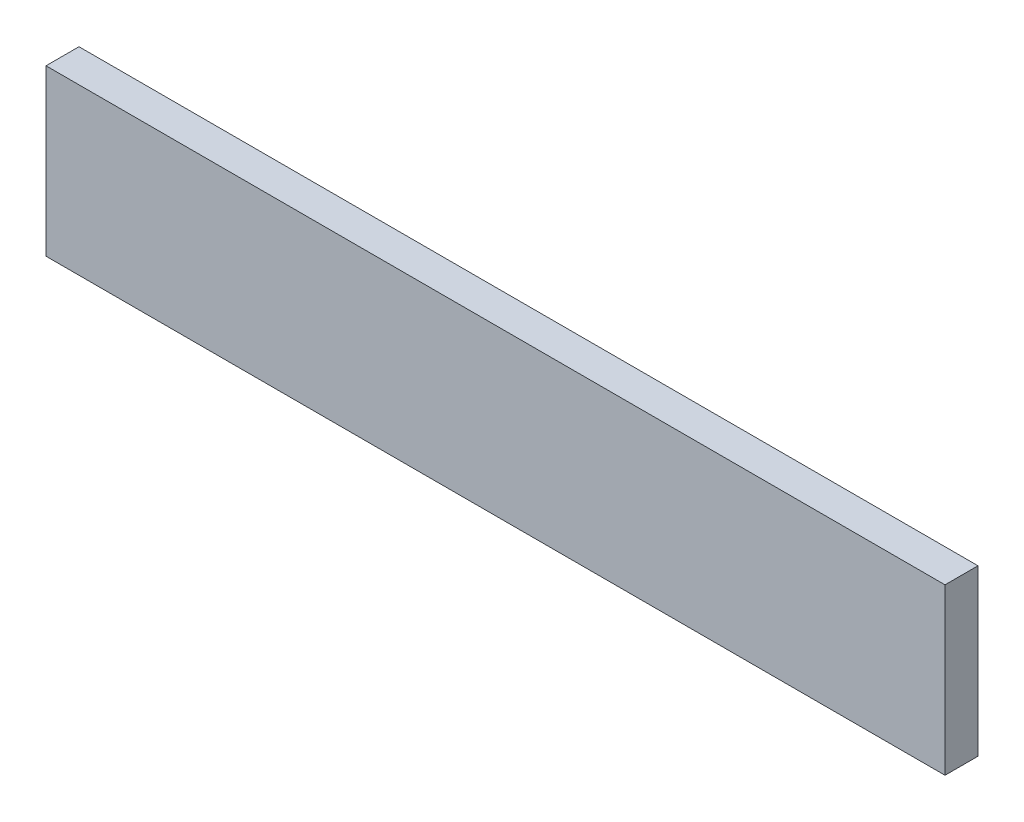
ISO-10303-21;
HEADER;
FILE_DESCRIPTION(('STEP AP214'),'2;1');
FILE_NAME('part.step','',(''),(''),'','','');
FILE_SCHEMA(('AUTOMOTIVE_DESIGN { 1 0 10303 214 1 1 1 1 }'));
ENDSEC;
DATA;
#1=APPLICATION_CONTEXT('core data for automotive mechanical design processes');
#2=APPLICATION_PROTOCOL_DEFINITION('international standard','automotive_design',2000,#1);
#3=PRODUCT_CONTEXT('',#1,'mechanical');
#4=PRODUCT('Part','Part','',(#3));
#5=PRODUCT_RELATED_PRODUCT_CATEGORY('part','',(#4));
#6=PRODUCT_DEFINITION_FORMATION('','',#4);
#7=PRODUCT_DEFINITION_CONTEXT('part definition',#1,'design');
#8=PRODUCT_DEFINITION('design','',#6,#7);
#9=PRODUCT_DEFINITION_SHAPE('','',#8);
#10=(LENGTH_UNIT() NAMED_UNIT(*) SI_UNIT(.MILLI.,.METRE.));
#11=(NAMED_UNIT(*) PLANE_ANGLE_UNIT() SI_UNIT($,.RADIAN.));
#12=(NAMED_UNIT(*) SI_UNIT($,.STERADIAN.) SOLID_ANGLE_UNIT());
#13=UNCERTAINTY_MEASURE_WITH_UNIT(LENGTH_MEASURE(1.E-05),#10,'distance_accuracy_value','');
#14=(GEOMETRIC_REPRESENTATION_CONTEXT(3) GLOBAL_UNCERTAINTY_ASSIGNED_CONTEXT((#13)) GLOBAL_UNIT_ASSIGNED_CONTEXT((#10,
#11,#12)) REPRESENTATION_CONTEXT('',''));
#15=CARTESIAN_POINT('',(0.,0.,0.));
#16=DIRECTION('',(0.,0.,1.));
#17=DIRECTION('',(1.,0.,0.));
#18=AXIS2_PLACEMENT_3D('',#15,#16,#17);
#19=CARTESIAN_POINT('',(0.,0.,5.08));
#20=DIRECTION('',(1.,0.,0.));
#21=DIRECTION('',(0.,0.,-1.));
#22=AXIS2_PLACEMENT_3D('',#19,#20,#21);
#23=PLANE('',#22);
#24=DIRECTION('',(0.,-1.,0.));
#25=VECTOR('',#24,1.);
#26=CARTESIAN_POINT('',(0.,0.,0.));
#27=LINE('',#26,#25);
#28=CARTESIAN_POINT('',(0.,25.4,0.));
#29=VERTEX_POINT('',#28);
#30=CARTESIAN_POINT('',(0.,0.,0.));
#31=VERTEX_POINT('',#30);
#32=EDGE_CURVE('E100',#29,#31,#27,.T.);
#33=ORIENTED_EDGE('',*,*,#32,.T.);
#34=DIRECTION('',(0.,0.,-1.));
#35=VECTOR('',#34,1.);
#36=CARTESIAN_POINT('',(0.,0.,5.08));
#37=LINE('',#36,#35);
#38=CARTESIAN_POINT('',(0.,0.,5.08));
#39=VERTEX_POINT('',#38);
#40=EDGE_CURVE('E11',#39,#31,#37,.T.);
#41=ORIENTED_EDGE('',*,*,#40,.F.);
#42=DIRECTION('',(0.,-1.,0.));
#43=VECTOR('',#42,1.);
#44=CARTESIAN_POINT('',(0.,0.,5.08));
#45=LINE('',#44,#43);
#46=CARTESIAN_POINT('',(0.,25.4,5.08));
#47=VERTEX_POINT('',#46);
#48=EDGE_CURVE('E88',#47,#39,#45,.T.);
#49=ORIENTED_EDGE('',*,*,#48,.F.);
#50=DIRECTION('',(0.,0.,-1.));
#51=VECTOR('',#50,1.);
#52=CARTESIAN_POINT('',(0.,25.4,5.08));
#53=LINE('',#52,#51);
#54=EDGE_CURVE('E96',#47,#29,#53,.T.);
#55=ORIENTED_EDGE('',*,*,#54,.T.);
#56=EDGE_LOOP('',(#33,#41,#49,#55));
#57=FACE_BOUND('',#56,.T.);
#58=ADVANCED_FACE('F37',(#57),#23,.F.);
#59=CARTESIAN_POINT('',(0.,0.,5.08));
#60=DIRECTION('',(0.,1.,0.));
#61=DIRECTION('',(0.,0.,1.));
#62=AXIS2_PLACEMENT_3D('',#59,#60,#61);
#63=PLANE('',#62);
#64=DIRECTION('',(1.,0.,0.));
#65=VECTOR('',#64,1.);
#66=CARTESIAN_POINT('',(0.,0.,0.));
#67=LINE('',#66,#65);
#68=CARTESIAN_POINT('',(138.43,0.,0.));
#69=VERTEX_POINT('',#68);
#70=EDGE_CURVE('E92',#31,#69,#67,.T.);
#71=ORIENTED_EDGE('',*,*,#70,.T.);
#72=DIRECTION('',(0.,0.,-1.));
#73=VECTOR('',#72,1.);
#74=CARTESIAN_POINT('',(138.43,0.,5.08));
#75=LINE('',#74,#73);
#76=CARTESIAN_POINT('',(138.43,0.,5.08));
#77=VERTEX_POINT('',#76);
#78=EDGE_CURVE('E45',#77,#69,#75,.T.);
#79=ORIENTED_EDGE('',*,*,#78,.F.);
#80=DIRECTION('',(1.,0.,0.));
#81=VECTOR('',#80,1.);
#82=CARTESIAN_POINT('',(0.,0.,5.08));
#83=LINE('',#82,#81);
#84=EDGE_CURVE('E83',#39,#77,#83,.T.);
#85=ORIENTED_EDGE('',*,*,#84,.F.);
#86=ORIENTED_EDGE('',*,*,#40,.T.);
#87=EDGE_LOOP('',(#71,#79,#85,#86));
#88=FACE_BOUND('',#87,.T.);
#89=ADVANCED_FACE('F91',(#88),#63,.F.);
#90=CARTESIAN_POINT('',(138.43,0.,5.08));
#91=DIRECTION('',(-1.,0.,0.));
#92=DIRECTION('',(0.,0.,1.));
#93=AXIS2_PLACEMENT_3D('',#90,#91,#92);
#94=PLANE('',#93);
#95=DIRECTION('',(0.,1.,0.));
#96=VECTOR('',#95,1.);
#97=CARTESIAN_POINT('',(138.43,0.,0.));
#98=LINE('',#97,#96);
#99=CARTESIAN_POINT('',(138.43,25.4,0.));
#100=VERTEX_POINT('',#99);
#101=EDGE_CURVE('E70',#69,#100,#98,.T.);
#102=ORIENTED_EDGE('',*,*,#101,.T.);
#103=DIRECTION('',(0.,0.,-1.));
#104=VECTOR('',#103,1.);
#105=CARTESIAN_POINT('',(138.43,25.4,5.08));
#106=LINE('',#105,#104);
#107=CARTESIAN_POINT('',(138.43,25.4,5.08));
#108=VERTEX_POINT('',#107);
#109=EDGE_CURVE('E93',#108,#100,#106,.T.);
#110=ORIENTED_EDGE('',*,*,#109,.F.);
#111=DIRECTION('',(0.,1.,0.));
#112=VECTOR('',#111,1.);
#113=CARTESIAN_POINT('',(138.43,0.,5.08));
#114=LINE('',#113,#112);
#115=EDGE_CURVE('E86',#77,#108,#114,.T.);
#116=ORIENTED_EDGE('',*,*,#115,.F.);
#117=ORIENTED_EDGE('',*,*,#78,.T.);
#118=EDGE_LOOP('',(#102,#110,#116,#117));
#119=FACE_BOUND('',#118,.T.);
#120=ADVANCED_FACE('F94',(#119),#94,.F.);
#121=CARTESIAN_POINT('',(0.,25.4,5.08));
#122=DIRECTION('',(0.,-1.,0.));
#123=DIRECTION('',(0.,0.,-1.));
#124=AXIS2_PLACEMENT_3D('',#121,#122,#123);
#125=PLANE('',#124);
#126=DIRECTION('',(-1.,0.,0.));
#127=VECTOR('',#126,1.);
#128=CARTESIAN_POINT('',(0.,25.4,0.));
#129=LINE('',#128,#127);
#130=EDGE_CURVE('E76',#100,#29,#129,.T.);
#131=ORIENTED_EDGE('',*,*,#130,.T.);
#132=ORIENTED_EDGE('',*,*,#54,.F.);
#133=DIRECTION('',(-1.,0.,0.));
#134=VECTOR('',#133,1.);
#135=CARTESIAN_POINT('',(0.,25.4,5.08));
#136=LINE('',#135,#134);
#137=EDGE_CURVE('E53',#108,#47,#136,.T.);
#138=ORIENTED_EDGE('',*,*,#137,.F.);
#139=ORIENTED_EDGE('',*,*,#109,.T.);
#140=EDGE_LOOP('',(#131,#132,#138,#139));
#141=FACE_BOUND('',#140,.T.);
#142=ADVANCED_FACE('F107',(#141),#125,.F.);
#143=CARTESIAN_POINT('',(0.,0.,5.08));
#144=DIRECTION('',(0.,0.,-1.));
#145=DIRECTION('',(-1.,0.,0.));
#146=AXIS2_PLACEMENT_3D('',#143,#144,#145);
#147=PLANE('',#146);
#148=ORIENTED_EDGE('',*,*,#48,.T.);
#149=ORIENTED_EDGE('',*,*,#84,.T.);
#150=ORIENTED_EDGE('',*,*,#115,.T.);
#151=ORIENTED_EDGE('',*,*,#137,.T.);
#152=EDGE_LOOP('',(#148,#149,#150,#151));
#153=FACE_BOUND('',#152,.T.);
#154=ADVANCED_FACE('F84',(#153),#147,.F.);
#155=CARTESIAN_POINT('',(0.,0.,0.));
#156=DIRECTION('',(0.,0.,-1.));
#157=DIRECTION('',(-1.,0.,0.));
#158=AXIS2_PLACEMENT_3D('',#155,#156,#157);
#159=PLANE('',#158);
#160=ORIENTED_EDGE('',*,*,#32,.F.);
#161=ORIENTED_EDGE('',*,*,#130,.F.);
#162=ORIENTED_EDGE('',*,*,#101,.F.);
#163=ORIENTED_EDGE('',*,*,#70,.F.);
#164=EDGE_LOOP('',(#160,#161,#162,#163));
#165=FACE_BOUND('',#164,.T.);
#166=ADVANCED_FACE('F110',(#165),#159,.T.);
#167=CLOSED_SHELL('',(#58,#89,#120,#142,#154,#166));
#168=MANIFOLD_SOLID_BREP('B2',#167);
#169=ADVANCED_BREP_SHAPE_REPRESENTATION('',(#18,#168),#14);
#170=SHAPE_DEFINITION_REPRESENTATION(#9,#169);
ENDSEC;
END-ISO-10303-21;
